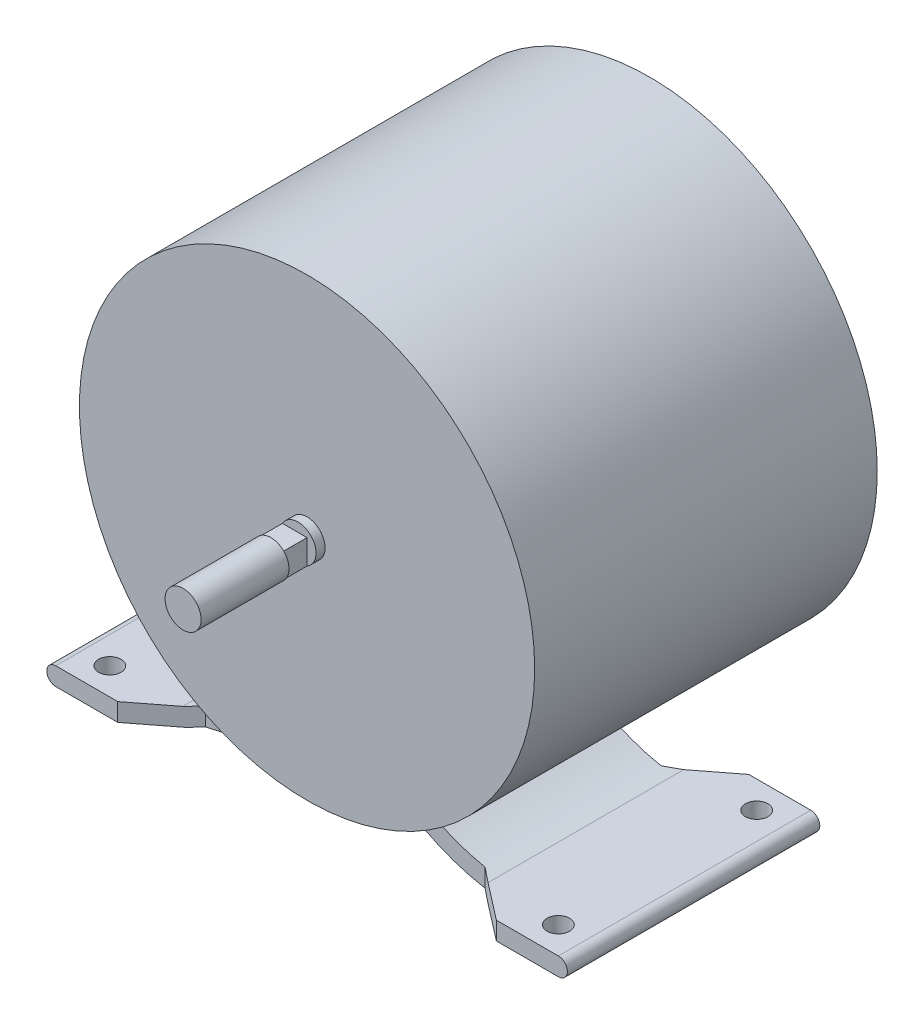
ISO-10303-21;
HEADER;
FILE_DESCRIPTION(('STEP AP214'),'2;1');
FILE_NAME('part.step','',(''),(''),'','','');
FILE_SCHEMA(('AUTOMOTIVE_DESIGN { 1 0 10303 214 1 1 1 1 }'));
ENDSEC;
DATA;
#1=APPLICATION_CONTEXT('core data for automotive mechanical design processes');
#2=APPLICATION_PROTOCOL_DEFINITION('international standard','automotive_design',2000,#1);
#3=PRODUCT_CONTEXT('',#1,'mechanical');
#4=PRODUCT('Part','Part','',(#3));
#5=PRODUCT_RELATED_PRODUCT_CATEGORY('part','',(#4));
#6=PRODUCT_DEFINITION_FORMATION('','',#4);
#7=PRODUCT_DEFINITION_CONTEXT('part definition',#1,'design');
#8=PRODUCT_DEFINITION('design','',#6,#7);
#9=PRODUCT_DEFINITION_SHAPE('','',#8);
#10=(LENGTH_UNIT() NAMED_UNIT(*) SI_UNIT(.MILLI.,.METRE.));
#11=(NAMED_UNIT(*) PLANE_ANGLE_UNIT() SI_UNIT($,.RADIAN.));
#12=(NAMED_UNIT(*) SI_UNIT($,.STERADIAN.) SOLID_ANGLE_UNIT());
#13=UNCERTAINTY_MEASURE_WITH_UNIT(LENGTH_MEASURE(1.E-05),#10,'distance_accuracy_value','');
#14=(GEOMETRIC_REPRESENTATION_CONTEXT(3) GLOBAL_UNCERTAINTY_ASSIGNED_CONTEXT((#13)) GLOBAL_UNIT_ASSIGNED_CONTEXT((#10,
#11,#12)) REPRESENTATION_CONTEXT('',''));
#15=CARTESIAN_POINT('',(0.,0.,0.));
#16=DIRECTION('',(0.,0.,1.));
#17=DIRECTION('',(1.,0.,0.));
#18=AXIS2_PLACEMENT_3D('',#15,#16,#17);
#19=CARTESIAN_POINT('',(0.,0.,0.));
#20=DIRECTION('',(0.,0.,1.));
#21=DIRECTION('',(1.,0.,0.));
#22=AXIS2_PLACEMENT_3D('',#19,#20,#21);
#23=PLANE('',#22);
#24=DIRECTION('',(0.,-1.,0.));
#25=VECTOR('',#24,1.);
#26=CARTESIAN_POINT('',(-42.,-42.5,0.));
#27=LINE('',#26,#25);
#28=CARTESIAN_POINT('',(-42.,-52.5,0.));
#29=VERTEX_POINT('',#28);
#30=CARTESIAN_POINT('',(-42.,-56.5,0.));
#31=VERTEX_POINT('',#30);
#32=EDGE_CURVE('E258',#29,#31,#27,.T.);
#33=ORIENTED_EDGE('',*,*,#32,.F.);
#34=DIRECTION('',(1.,0.,0.));
#35=VECTOR('',#34,1.);
#36=CARTESIAN_POINT('',(-55.75,-52.5,0.));
#37=LINE('',#36,#35);
#38=CARTESIAN_POINT('',(-55.75,-52.5,0.));
#39=VERTEX_POINT('',#38);
#40=EDGE_CURVE('E325',#39,#29,#37,.T.);
#41=ORIENTED_EDGE('',*,*,#40,.F.);
#42=CARTESIAN_POINT('',(-55.75,-54.5,0.));
#43=DIRECTION('',(0.,0.,1.));
#44=DIRECTION('',(1.,0.,0.));
#45=AXIS2_PLACEMENT_3D('',#42,#43,#44);
#46=CIRCLE('',#45,2.);
#47=CARTESIAN_POINT('',(-55.75,-56.5,0.));
#48=VERTEX_POINT('',#47);
#49=EDGE_CURVE('E330',#39,#48,#46,.T.);
#50=ORIENTED_EDGE('',*,*,#49,.T.);
#51=DIRECTION('',(1.,0.,0.));
#52=VECTOR('',#51,1.);
#53=CARTESIAN_POINT('',(-55.75,-56.5,0.));
#54=LINE('',#53,#52);
#55=EDGE_CURVE('E353',#48,#31,#54,.T.);
#56=ORIENTED_EDGE('',*,*,#55,.T.);
#57=EDGE_LOOP('',(#33,#41,#50,#56));
#58=FACE_BOUND('',#57,.T.);
#59=ADVANCED_FACE('F47',(#58),#23,.T.);
#60=CARTESIAN_POINT('',(0.,0.,0.));
#61=DIRECTION('',(0.,0.,1.));
#62=DIRECTION('',(1.,0.,0.));
#63=AXIS2_PLACEMENT_3D('',#60,#61,#62);
#64=CIRCLE('',#63,4.);
#65=CARTESIAN_POINT('',(4.,0.,0.));
#66=VERTEX_POINT('',#65);
#67=EDGE_CURVE('E395',#66,#66,#64,.T.);
#68=ORIENTED_EDGE('',*,*,#67,.F.);
#69=EDGE_LOOP('',(#68));
#70=FACE_BOUND('',#69,.T.);
#71=CARTESIAN_POINT('',(0.,0.,0.));
#72=DIRECTION('',(0.,0.,1.));
#73=DIRECTION('',(1.,0.,0.));
#74=AXIS2_PLACEMENT_3D('',#71,#72,#73);
#75=CIRCLE('',#74,50.5);
#76=CARTESIAN_POINT('',(50.5,0.,0.));
#77=VERTEX_POINT('',#76);
#78=EDGE_CURVE('E451',#77,#77,#75,.T.);
#79=ORIENTED_EDGE('',*,*,#78,.T.);
#80=EDGE_LOOP('',(#79));
#81=FACE_BOUND('',#80,.T.);
#82=ADVANCED_FACE('F429',(#70,#81),#23,.T.);
#83=CARTESIAN_POINT('',(-38.7375943856709,-11.7087805856879,-56.));
#84=DIRECTION('',(0.,0.,1.));
#85=DIRECTION('',(1.,0.,0.));
#86=AXIS2_PLACEMENT_3D('',#83,#84,#85);
#87=PLANE('',#86);
#88=DIRECTION('',(1.,0.,0.));
#89=VECTOR('',#88,1.);
#90=CARTESIAN_POINT('',(-55.75,-52.5,-56.));
#91=LINE('',#90,#89);
#92=CARTESIAN_POINT('',(-55.75,-52.5,-56.));
#93=VERTEX_POINT('',#92);
#94=CARTESIAN_POINT('',(-42.,-52.5,-56.));
#95=VERTEX_POINT('',#94);
#96=EDGE_CURVE('E326',#93,#95,#91,.T.);
#97=ORIENTED_EDGE('',*,*,#96,.T.);
#98=DIRECTION('',(0.,-1.,0.));
#99=VECTOR('',#98,1.);
#100=CARTESIAN_POINT('',(-42.,-11.7087805856879,-56.));
#101=LINE('',#100,#99);
#102=CARTESIAN_POINT('',(-42.,-56.5,-56.));
#103=VERTEX_POINT('',#102);
#104=EDGE_CURVE('E457',#95,#103,#101,.T.);
#105=ORIENTED_EDGE('',*,*,#104,.T.);
#106=DIRECTION('',(1.,0.,0.));
#107=VECTOR('',#106,1.);
#108=CARTESIAN_POINT('',(-55.75,-56.5,-56.));
#109=LINE('',#108,#107);
#110=CARTESIAN_POINT('',(-55.75,-56.5,-56.));
#111=VERTEX_POINT('',#110);
#112=EDGE_CURVE('E337',#111,#103,#109,.T.);
#113=ORIENTED_EDGE('',*,*,#112,.F.);
#114=CARTESIAN_POINT('',(-55.75,-54.5,-56.));
#115=DIRECTION('',(0.,0.,1.));
#116=DIRECTION('',(1.,0.,0.));
#117=AXIS2_PLACEMENT_3D('',#114,#115,#116);
#118=CIRCLE('',#117,2.);
#119=EDGE_CURVE('E340',#93,#111,#118,.T.);
#120=ORIENTED_EDGE('',*,*,#119,.F.);
#121=EDGE_LOOP('',(#97,#105,#113,#120));
#122=FACE_BOUND('',#121,.T.);
#123=ADVANCED_FACE('F434',(#122),#87,.F.);
#124=CARTESIAN_POINT('',(0.,0.,-76.));
#125=DIRECTION('',(0.,0.,1.));
#126=DIRECTION('',(1.,0.,0.));
#127=AXIS2_PLACEMENT_3D('',#124,#125,#126);
#128=CYLINDRICAL_SURFACE('',#127,50.5);
#129=DIRECTION('',(0.,0.,1.));
#130=VECTOR('',#129,1.);
#131=CARTESIAN_POINT('',(18.0122274424441,-47.1784872856439,-56.));
#132=LINE('',#131,#130);
#133=CARTESIAN_POINT('',(18.0122274424441,-47.1784872856439,-47.5));
#134=VERTEX_POINT('',#133);
#135=CARTESIAN_POINT('',(18.0122274424441,-47.1784872856439,-8.50000000000001));
#136=VERTEX_POINT('',#135);
#137=EDGE_CURVE('E382',#134,#136,#132,.T.);
#138=ORIENTED_EDGE('',*,*,#137,.F.);
#139=CARTESIAN_POINT('',(0.,0.,-47.5));
#140=DIRECTION('',(0.,0.,1.));
#141=DIRECTION('',(1.,0.,0.));
#142=AXIS2_PLACEMENT_3D('',#139,#140,#141);
#143=CIRCLE('',#142,50.5);
#144=CARTESIAN_POINT('',(-18.0122274424441,-47.1784872856439,-47.5));
#145=VERTEX_POINT('',#144);
#146=EDGE_CURVE('E249',#145,#134,#143,.T.);
#147=ORIENTED_EDGE('',*,*,#146,.F.);
#148=DIRECTION('',(0.,0.,1.));
#149=VECTOR('',#148,1.);
#150=CARTESIAN_POINT('',(-18.0122274424441,-47.1784872856439,-56.));
#151=LINE('',#150,#149);
#152=CARTESIAN_POINT('',(-18.0122274424441,-47.1784872856439,-8.50000000000001));
#153=VERTEX_POINT('',#152);
#154=EDGE_CURVE('E385',#145,#153,#151,.T.);
#155=ORIENTED_EDGE('',*,*,#154,.T.);
#156=CARTESIAN_POINT('',(0.,0.,-8.50000000000001));
#157=DIRECTION('',(0.,0.,-1.));
#158=DIRECTION('',(-1.,0.,0.));
#159=AXIS2_PLACEMENT_3D('',#156,#157,#158);
#160=CIRCLE('',#159,50.5);
#161=EDGE_CURVE('E245',#136,#153,#160,.T.);
#162=ORIENTED_EDGE('',*,*,#161,.F.);
#163=EDGE_LOOP('',(#138,#147,#155,#162));
#164=FACE_BOUND('',#163,.T.);
#165=ORIENTED_EDGE('',*,*,#78,.F.);
#166=EDGE_LOOP('',(#165));
#167=FACE_BOUND('',#166,.T.);
#168=CARTESIAN_POINT('',(0.,0.,-76.));
#169=DIRECTION('',(0.,0.,1.));
#170=DIRECTION('',(1.,0.,0.));
#171=AXIS2_PLACEMENT_3D('',#168,#169,#170);
#172=CIRCLE('',#171,50.5);
#173=CARTESIAN_POINT('',(50.5,0.,-76.));
#174=VERTEX_POINT('',#173);
#175=EDGE_CURVE('E392',#174,#174,#172,.F.);
#176=ORIENTED_EDGE('',*,*,#175,.F.);
#177=EDGE_LOOP('',(#176));
#178=FACE_BOUND('',#177,.T.);
#179=ADVANCED_FACE('F49',(#164,#167,#178),#128,.T.);
#180=DIRECTION('',(0.,-1.,0.));
#181=VECTOR('',#180,1.);
#182=CARTESIAN_POINT('',(42.,-42.5,0.));
#183=LINE('',#182,#181);
#184=CARTESIAN_POINT('',(42.,-52.5,0.));
#185=VERTEX_POINT('',#184);
#186=CARTESIAN_POINT('',(42.,-56.5,0.));
#187=VERTEX_POINT('',#186);
#188=EDGE_CURVE('E261',#185,#187,#183,.T.);
#189=ORIENTED_EDGE('',*,*,#188,.T.);
#190=DIRECTION('',(1.,0.,0.));
#191=VECTOR('',#190,1.);
#192=CARTESIAN_POINT('',(33.6351588391696,-56.5,0.));
#193=LINE('',#192,#191);
#194=CARTESIAN_POINT('',(55.75,-56.5,0.));
#195=VERTEX_POINT('',#194);
#196=EDGE_CURVE('E351',#187,#195,#193,.T.);
#197=ORIENTED_EDGE('',*,*,#196,.T.);
#198=CARTESIAN_POINT('',(55.75,-54.5,0.));
#199=DIRECTION('',(0.,0.,-1.));
#200=DIRECTION('',(-1.,0.,0.));
#201=AXIS2_PLACEMENT_3D('',#198,#199,#200);
#202=CIRCLE('',#201,2.);
#203=CARTESIAN_POINT('',(55.75,-52.5,0.));
#204=VERTEX_POINT('',#203);
#205=EDGE_CURVE('E348',#204,#195,#202,.T.);
#206=ORIENTED_EDGE('',*,*,#205,.F.);
#207=DIRECTION('',(1.,0.,0.));
#208=VECTOR('',#207,1.);
#209=CARTESIAN_POINT('',(33.8675484920727,-52.5,0.));
#210=LINE('',#209,#208);
#211=EDGE_CURVE('E346',#185,#204,#210,.T.);
#212=ORIENTED_EDGE('',*,*,#211,.F.);
#213=EDGE_LOOP('',(#189,#197,#206,#212));
#214=FACE_BOUND('',#213,.T.);
#215=ADVANCED_FACE('F426',(#214),#23,.T.);
#216=CARTESIAN_POINT('',(0.,0.,27.5));
#217=DIRECTION('',(0.,0.,-1.));
#218=DIRECTION('',(-1.,0.,0.));
#219=AXIS2_PLACEMENT_3D('',#216,#217,#218);
#220=CYLINDRICAL_SURFACE('',#219,4.);
#221=CARTESIAN_POINT('',(0.,0.,2.));
#222=DIRECTION('',(0.,0.,-1.));
#223=DIRECTION('',(-1.,0.,0.));
#224=AXIS2_PLACEMENT_3D('',#221,#222,#223);
#225=CIRCLE('',#224,4.);
#226=CARTESIAN_POINT('',(-3.46410161513775,2.,2.));
#227=VERTEX_POINT('',#226);
#228=CARTESIAN_POINT('',(1.99999999999999,-3.46410161513776,2.));
#229=VERTEX_POINT('',#228);
#230=EDGE_CURVE('E12',#227,#229,#225,.T.);
#231=ORIENTED_EDGE('',*,*,#230,.T.);
#232=DIRECTION('',(0.,0.,-1.));
#233=VECTOR('',#232,1.);
#234=CARTESIAN_POINT('',(1.99999999999999,-3.46410161513776,27.5));
#235=LINE('',#234,#233);
#236=CARTESIAN_POINT('',(1.99999999999999,-3.46410161513776,8.00000000000001));
#237=VERTEX_POINT('',#236);
#238=EDGE_CURVE('E207',#229,#237,#235,.F.);
#239=ORIENTED_EDGE('',*,*,#238,.T.);
#240=CARTESIAN_POINT('',(0.,0.,8.00000000000001));
#241=DIRECTION('',(0.,0.,1.));
#242=DIRECTION('',(1.,0.,0.));
#243=AXIS2_PLACEMENT_3D('',#240,#241,#242);
#244=CIRCLE('',#243,4.);
#245=CARTESIAN_POINT('',(-3.46410161513775,2.,8.00000000000001));
#246=VERTEX_POINT('',#245);
#247=EDGE_CURVE('E69',#237,#246,#244,.T.);
#248=ORIENTED_EDGE('',*,*,#247,.T.);
#249=DIRECTION('',(0.,0.,-1.));
#250=VECTOR('',#249,1.);
#251=CARTESIAN_POINT('',(-3.46410161513775,2.,27.5));
#252=LINE('',#251,#250);
#253=EDGE_CURVE('E55',#246,#227,#252,.T.);
#254=ORIENTED_EDGE('',*,*,#253,.T.);
#255=EDGE_LOOP('',(#231,#239,#248,#254));
#256=FACE_BOUND('',#255,.T.);
#257=CARTESIAN_POINT('',(0.,0.,27.5));
#258=DIRECTION('',(0.,0.,1.));
#259=DIRECTION('',(1.,0.,0.));
#260=AXIS2_PLACEMENT_3D('',#257,#258,#259);
#261=CIRCLE('',#260,4.);
#262=CARTESIAN_POINT('',(4.,0.,27.5));
#263=VERTEX_POINT('',#262);
#264=EDGE_CURVE('E454',#263,#263,#261,.T.);
#265=ORIENTED_EDGE('',*,*,#264,.F.);
#266=EDGE_LOOP('',(#265));
#267=FACE_BOUND('',#266,.T.);
#268=ORIENTED_EDGE('',*,*,#67,.T.);
#269=EDGE_LOOP('',(#268));
#270=FACE_BOUND('',#269,.T.);
#271=ADVANCED_FACE('F423',(#256,#267,#270),#220,.T.);
#272=CARTESIAN_POINT('',(0.,0.,27.5));
#273=DIRECTION('',(0.,0.,1.));
#274=DIRECTION('',(1.,0.,0.));
#275=AXIS2_PLACEMENT_3D('',#272,#273,#274);
#276=PLANE('',#275);
#277=ORIENTED_EDGE('',*,*,#264,.T.);
#278=EDGE_LOOP('',(#277));
#279=FACE_BOUND('',#278,.T.);
#280=ADVANCED_FACE('F420',(#279),#276,.T.);
#281=CARTESIAN_POINT('',(0.,0.,-82.));
#282=DIRECTION('',(0.,0.,-1.));
#283=DIRECTION('',(-1.,0.,0.));
#284=AXIS2_PLACEMENT_3D('',#281,#282,#283);
#285=PLANE('',#284);
#286=CARTESIAN_POINT('',(0.,0.,-82.));
#287=DIRECTION('',(0.,0.,-1.));
#288=DIRECTION('',(-1.,0.,0.));
#289=AXIS2_PLACEMENT_3D('',#286,#287,#288);
#290=CIRCLE('',#289,15.5);
#291=CARTESIAN_POINT('',(-15.5,0.,-82.));
#292=VERTEX_POINT('',#291);
#293=EDGE_CURVE('E391',#292,#292,#290,.T.);
#294=ORIENTED_EDGE('',*,*,#293,.T.);
#295=EDGE_LOOP('',(#294));
#296=FACE_BOUND('',#295,.T.);
#297=ADVANCED_FACE('F416',(#296),#285,.T.);
#298=CARTESIAN_POINT('',(0.,0.,-82.));
#299=DIRECTION('',(0.,0.,1.));
#300=DIRECTION('',(1.,0.,0.));
#301=AXIS2_PLACEMENT_3D('',#298,#299,#300);
#302=CONICAL_SURFACE('',#301,15.5,1.40101805282656);
#303=ORIENTED_EDGE('',*,*,#175,.T.);
#304=EDGE_LOOP('',(#303));
#305=FACE_BOUND('',#304,.T.);
#306=ORIENTED_EDGE('',*,*,#293,.F.);
#307=EDGE_LOOP('',(#306));
#308=FACE_BOUND('',#307,.T.);
#309=ADVANCED_FACE('F405',(#305,#308),#302,.T.);
#310=CARTESIAN_POINT('',(-55.75,-52.5,-56.));
#311=DIRECTION('',(0.,-1.,0.));
#312=DIRECTION('',(0.,0.,-1.));
#313=AXIS2_PLACEMENT_3D('',#310,#311,#312);
#314=PLANE('',#313);
#315=CARTESIAN_POINT('',(-49.75,-52.5,-50.));
#316=DIRECTION('',(0.,-1.,0.));
#317=DIRECTION('',(0.,0.,-1.));
#318=AXIS2_PLACEMENT_3D('',#315,#316,#317);
#319=CIRCLE('',#318,2.5);
#320=CARTESIAN_POINT('',(-49.75,-52.5,-52.5));
#321=VERTEX_POINT('',#320);
#322=EDGE_CURVE('E227',#321,#321,#319,.F.);
#323=ORIENTED_EDGE('',*,*,#322,.F.);
#324=EDGE_LOOP('',(#323));
#325=FACE_BOUND('',#324,.T.);
#326=CARTESIAN_POINT('',(-49.75,-52.5,-6.));
#327=DIRECTION('',(0.,-1.,0.));
#328=DIRECTION('',(0.,0.,-1.));
#329=AXIS2_PLACEMENT_3D('',#326,#327,#328);
#330=CIRCLE('',#329,2.5);
#331=CARTESIAN_POINT('',(-49.75,-52.5,-8.5));
#332=VERTEX_POINT('',#331);
#333=EDGE_CURVE('E242',#332,#332,#330,.F.);
#334=ORIENTED_EDGE('',*,*,#333,.F.);
#335=EDGE_LOOP('',(#334));
#336=FACE_BOUND('',#335,.T.);
#337=ORIENTED_EDGE('',*,*,#40,.T.);
#338=DIRECTION('',(0.791285001392167,0.,-0.611447501075766));
#339=VECTOR('',#338,1.);
#340=CARTESIAN_POINT('',(-23.5148771021992,-52.5,-14.2839586028461));
#341=LINE('',#340,#339);
#342=CARTESIAN_POINT('',(-33.8675484920727,-52.5,-6.28416707430744));
#343=VERTEX_POINT('',#342);
#344=EDGE_CURVE('E297',#29,#343,#341,.T.);
#345=ORIENTED_EDGE('',*,*,#344,.T.);
#346=DIRECTION('',(0.,0.,1.));
#347=VECTOR('',#346,1.);
#348=CARTESIAN_POINT('',(-33.8675484920727,-52.5,-56.));
#349=LINE('',#348,#347);
#350=CARTESIAN_POINT('',(-33.8675484920727,-52.5,-49.7158329256926));
#351=VERTEX_POINT('',#350);
#352=EDGE_CURVE('E388',#351,#343,#349,.T.);
#353=ORIENTED_EDGE('',*,*,#352,.F.);
#354=DIRECTION('',(-0.791285001392167,0.,-0.611447501075766));
#355=VECTOR('',#354,1.);
#356=CARTESIAN_POINT('',(-50.6093143596378,-52.5,-62.6526520051746));
#357=LINE('',#356,#355);
#358=EDGE_CURVE('E289',#351,#95,#357,.T.);
#359=ORIENTED_EDGE('',*,*,#358,.T.);
#360=ORIENTED_EDGE('',*,*,#96,.F.);
#361=DIRECTION('',(0.,0.,1.));
#362=VECTOR('',#361,1.);
#363=CARTESIAN_POINT('',(-55.75,-52.5,-56.));
#364=LINE('',#363,#362);
#365=EDGE_CURVE('E343',#93,#39,#364,.T.);
#366=ORIENTED_EDGE('',*,*,#365,.T.);
#367=EDGE_LOOP('',(#337,#345,#353,#359,#360,#366));
#368=FACE_BOUND('',#367,.T.);
#369=ADVANCED_FACE('F415',(#325,#336,#368),#314,.F.);
#370=CARTESIAN_POINT('',(-38.7375943856709,-11.7087805856879,-56.));
#371=DIRECTION('',(0.,0.,1.));
#372=DIRECTION('',(1.,0.,0.));
#373=AXIS2_PLACEMENT_3D('',#370,#371,#372);
#374=CYLINDRICAL_SURFACE('',#373,41.0809071018679);
#375=ORIENTED_EDGE('',*,*,#352,.T.);
#376=CARTESIAN_POINT('',(-38.7375943856709,-11.7087805856879,-2.5209497928907));
#377=DIRECTION('',(-0.611447501075766,0.,-0.791285001392167));
#378=DIRECTION('',(-0.791285001392167,0.,0.611447501075766));
#379=AXIS2_PLACEMENT_3D('',#376,#377,#378);
#380=ELLIPSE('',#379,51.9167013523461,41.0809071018679);
#381=CARTESIAN_POINT('',(-31.,-52.0544192773128,-8.50000000000001));
#382=VERTEX_POINT('',#381);
#383=EDGE_CURVE('E294',#343,#382,#380,.F.);
#384=ORIENTED_EDGE('',*,*,#383,.T.);
#385=CARTESIAN_POINT('',(-38.7375943856709,-11.7087805856879,-8.50000000000001));
#386=DIRECTION('',(0.,0.,-1.));
#387=DIRECTION('',(-1.,0.,0.));
#388=AXIS2_PLACEMENT_3D('',#385,#386,#387);
#389=CIRCLE('',#388,41.0809071018679);
#390=EDGE_CURVE('E317',#382,#153,#389,.F.);
#391=ORIENTED_EDGE('',*,*,#390,.T.);
#392=ORIENTED_EDGE('',*,*,#154,.F.);
#393=CARTESIAN_POINT('',(-38.7375943856709,-11.7087805856879,-47.5));
#394=DIRECTION('',(0.,0.,1.));
#395=DIRECTION('',(1.,0.,0.));
#396=AXIS2_PLACEMENT_3D('',#393,#394,#395);
#397=CIRCLE('',#396,41.0809071018679);
#398=CARTESIAN_POINT('',(-31.,-52.0544192773128,-47.5));
#399=VERTEX_POINT('',#398);
#400=EDGE_CURVE('E307',#145,#399,#397,.F.);
#401=ORIENTED_EDGE('',*,*,#400,.T.);
#402=CARTESIAN_POINT('',(-38.7375943856709,-11.7087805856879,-53.4790502071093));
#403=DIRECTION('',(-0.611447501075766,0.,0.791285001392167));
#404=DIRECTION('',(0.791285001392167,0.,0.611447501075766));
#405=AXIS2_PLACEMENT_3D('',#402,#403,#404);
#406=ELLIPSE('',#405,51.9167013523462,41.0809071018679);
#407=EDGE_CURVE('E286',#399,#351,#406,.F.);
#408=ORIENTED_EDGE('',*,*,#407,.T.);
#409=EDGE_LOOP('',(#375,#384,#391,#392,#401,#408));
#410=FACE_BOUND('',#409,.T.);
#411=ADVANCED_FACE('F523',(#410),#374,.F.);
#412=CARTESIAN_POINT('',(38.7375943856709,-11.7087805856879,-56.));
#413=DIRECTION('',(0.,0.,1.));
#414=DIRECTION('',(1.,0.,0.));
#415=AXIS2_PLACEMENT_3D('',#412,#413,#414);
#416=CYLINDRICAL_SURFACE('',#415,41.0809071018679);
#417=CARTESIAN_POINT('',(38.7375943856709,-11.7087805856879,-2.5209497928907));
#418=DIRECTION('',(0.611447501075766,0.,-0.791285001392167));
#419=DIRECTION('',(0.791285001392167,0.,0.611447501075766));
#420=AXIS2_PLACEMENT_3D('',#417,#418,#419);
#421=ELLIPSE('',#420,51.9167013523461,41.0809071018679);
#422=CARTESIAN_POINT('',(33.8675484920727,-52.5,-6.28416707430748));
#423=VERTEX_POINT('',#422);
#424=CARTESIAN_POINT('',(31.,-52.0544192773128,-8.50000000000001));
#425=VERTEX_POINT('',#424);
#426=EDGE_CURVE('E323',#423,#425,#421,.T.);
#427=ORIENTED_EDGE('',*,*,#426,.F.);
#428=DIRECTION('',(0.,0.,1.));
#429=VECTOR('',#428,1.);
#430=CARTESIAN_POINT('',(33.8675484920727,-52.5,-56.));
#431=LINE('',#430,#429);
#432=CARTESIAN_POINT('',(33.8675484920727,-52.5,-49.7158329256925));
#433=VERTEX_POINT('',#432);
#434=EDGE_CURVE('E379',#433,#423,#431,.T.);
#435=ORIENTED_EDGE('',*,*,#434,.F.);
#436=CARTESIAN_POINT('',(38.7375943856709,-11.7087805856879,-53.4790502071093));
#437=DIRECTION('',(0.611447501075766,0.,0.791285001392167));
#438=DIRECTION('',(-0.791285001392167,0.,0.611447501075766));
#439=AXIS2_PLACEMENT_3D('',#436,#437,#438);
#440=ELLIPSE('',#439,51.9167013523461,41.0809071018679);
#441=CARTESIAN_POINT('',(31.,-52.0544192773128,-47.5));
#442=VERTEX_POINT('',#441);
#443=EDGE_CURVE('E282',#442,#433,#440,.T.);
#444=ORIENTED_EDGE('',*,*,#443,.F.);
#445=CARTESIAN_POINT('',(38.7375943856709,-11.7087805856879,-47.5));
#446=DIRECTION('',(0.,0.,1.));
#447=DIRECTION('',(1.,0.,0.));
#448=AXIS2_PLACEMENT_3D('',#445,#446,#447);
#449=CIRCLE('',#448,41.0809071018679);
#450=EDGE_CURVE('E305',#134,#442,#449,.T.);
#451=ORIENTED_EDGE('',*,*,#450,.F.);
#452=ORIENTED_EDGE('',*,*,#137,.T.);
#453=CARTESIAN_POINT('',(38.7375943856709,-11.7087805856879,-8.50000000000001));
#454=DIRECTION('',(0.,0.,-1.));
#455=DIRECTION('',(-1.,0.,0.));
#456=AXIS2_PLACEMENT_3D('',#453,#454,#455);
#457=CIRCLE('',#456,41.0809071018679);
#458=EDGE_CURVE('E315',#425,#136,#457,.T.);
#459=ORIENTED_EDGE('',*,*,#458,.F.);
#460=EDGE_LOOP('',(#427,#435,#444,#451,#452,#459));
#461=FACE_BOUND('',#460,.T.);
#462=ADVANCED_FACE('F498',(#461),#416,.F.);
#463=CARTESIAN_POINT('',(33.8675484920727,-52.5,-56.));
#464=DIRECTION('',(0.,-1.,0.));
#465=DIRECTION('',(0.,0.,-1.));
#466=AXIS2_PLACEMENT_3D('',#463,#464,#465);
#467=PLANE('',#466);
#468=CARTESIAN_POINT('',(49.75,-52.5,-5.99999999999996));
#469=DIRECTION('',(0.,-1.,0.));
#470=DIRECTION('',(0.,0.,-1.));
#471=AXIS2_PLACEMENT_3D('',#468,#469,#470);
#472=CIRCLE('',#471,2.5);
#473=CARTESIAN_POINT('',(49.75,-52.5,-8.49999999999996));
#474=VERTEX_POINT('',#473);
#475=EDGE_CURVE('E222',#474,#474,#472,.F.);
#476=ORIENTED_EDGE('',*,*,#475,.F.);
#477=EDGE_LOOP('',(#476));
#478=FACE_BOUND('',#477,.T.);
#479=CARTESIAN_POINT('',(49.75,-52.5,-50.));
#480=DIRECTION('',(0.,-1.,0.));
#481=DIRECTION('',(0.,0.,-1.));
#482=AXIS2_PLACEMENT_3D('',#479,#480,#481);
#483=CIRCLE('',#482,2.5);
#484=CARTESIAN_POINT('',(49.75,-52.5,-52.5));
#485=VERTEX_POINT('',#484);
#486=EDGE_CURVE('E234',#485,#485,#483,.F.);
#487=ORIENTED_EDGE('',*,*,#486,.F.);
#488=EDGE_LOOP('',(#487));
#489=FACE_BOUND('',#488,.T.);
#490=ORIENTED_EDGE('',*,*,#434,.T.);
#491=DIRECTION('',(0.791285001392167,0.,0.611447501075766));
#492=VECTOR('',#491,1.);
#493=CARTESIAN_POINT('',(9.8135749937428,-52.5,-24.871328413926));
#494=LINE('',#493,#492);
#495=EDGE_CURVE('E320',#423,#185,#494,.T.);
#496=ORIENTED_EDGE('',*,*,#495,.T.);
#497=ORIENTED_EDGE('',*,*,#211,.T.);
#498=DIRECTION('',(0.,0.,1.));
#499=VECTOR('',#498,1.);
#500=CARTESIAN_POINT('',(55.75,-52.5,-56.));
#501=LINE('',#500,#499);
#502=CARTESIAN_POINT('',(55.75,-52.5,-56.));
#503=VERTEX_POINT('',#502);
#504=EDGE_CURVE('E376',#503,#204,#501,.T.);
#505=ORIENTED_EDGE('',*,*,#504,.F.);
#506=DIRECTION('',(1.,0.,0.));
#507=VECTOR('',#506,1.);
#508=CARTESIAN_POINT('',(33.8675484920727,-52.5,-56.));
#509=LINE('',#508,#507);
#510=CARTESIAN_POINT('',(42.,-52.5,-56.));
#511=VERTEX_POINT('',#510);
#512=EDGE_CURVE('E329',#511,#503,#509,.T.);
#513=ORIENTED_EDGE('',*,*,#512,.F.);
#514=DIRECTION('',(-0.791285001392167,0.,0.611447501075766));
#515=VECTOR('',#514,1.);
#516=CARTESIAN_POINT('',(36.9080122511813,-52.5,-52.0652821940947));
#517=LINE('',#516,#515);
#518=EDGE_CURVE('E279',#511,#433,#517,.T.);
#519=ORIENTED_EDGE('',*,*,#518,.T.);
#520=EDGE_LOOP('',(#490,#496,#497,#505,#513,#519));
#521=FACE_BOUND('',#520,.T.);
#522=ADVANCED_FACE('F492',(#478,#489,#521),#467,.F.);
#523=CARTESIAN_POINT('',(55.75,-54.5,-56.));
#524=DIRECTION('',(0.,0.,1.));
#525=DIRECTION('',(1.,0.,0.));
#526=AXIS2_PLACEMENT_3D('',#523,#524,#525);
#527=CYLINDRICAL_SURFACE('',#526,2.);
#528=ORIENTED_EDGE('',*,*,#205,.T.);
#529=DIRECTION('',(0.,0.,1.));
#530=VECTOR('',#529,1.);
#531=CARTESIAN_POINT('',(55.75,-56.5,-56.));
#532=LINE('',#531,#530);
#533=CARTESIAN_POINT('',(55.75,-56.5,-56.));
#534=VERTEX_POINT('',#533);
#535=EDGE_CURVE('E373',#534,#195,#532,.T.);
#536=ORIENTED_EDGE('',*,*,#535,.F.);
#537=CARTESIAN_POINT('',(55.75,-54.5,-56.));
#538=DIRECTION('',(0.,0.,-1.));
#539=DIRECTION('',(-1.,0.,0.));
#540=AXIS2_PLACEMENT_3D('',#537,#538,#539);
#541=CIRCLE('',#540,2.);
#542=EDGE_CURVE('E332',#503,#534,#541,.T.);
#543=ORIENTED_EDGE('',*,*,#542,.F.);
#544=ORIENTED_EDGE('',*,*,#504,.T.);
#545=EDGE_LOOP('',(#528,#536,#543,#544));
#546=FACE_BOUND('',#545,.T.);
#547=ADVANCED_FACE('F548',(#546),#527,.T.);
#548=CARTESIAN_POINT('',(33.6351588391696,-56.5,-56.));
#549=DIRECTION('',(0.,-1.,0.));
#550=DIRECTION('',(0.,0.,-1.));
#551=AXIS2_PLACEMENT_3D('',#548,#549,#550);
#552=PLANE('',#551);
#553=CARTESIAN_POINT('',(49.75,-56.5,-5.99999999999996));
#554=DIRECTION('',(0.,-1.,0.));
#555=DIRECTION('',(0.,0.,1.));
#556=AXIS2_PLACEMENT_3D('',#553,#554,#555);
#557=CIRCLE('',#556,2.5);
#558=CARTESIAN_POINT('',(49.75,-56.5,-3.49999999999995));
#559=VERTEX_POINT('',#558);
#560=EDGE_CURVE('E219',#559,#559,#557,.T.);
#561=ORIENTED_EDGE('',*,*,#560,.F.);
#562=EDGE_LOOP('',(#561));
#563=FACE_BOUND('',#562,.T.);
#564=CARTESIAN_POINT('',(49.75,-56.5,-50.));
#565=DIRECTION('',(0.,-1.,0.));
#566=DIRECTION('',(0.,0.,-1.));
#567=AXIS2_PLACEMENT_3D('',#564,#565,#566);
#568=CIRCLE('',#567,2.5);
#569=CARTESIAN_POINT('',(49.75,-56.5,-52.5));
#570=VERTEX_POINT('',#569);
#571=EDGE_CURVE('E237',#570,#570,#568,.T.);
#572=ORIENTED_EDGE('',*,*,#571,.F.);
#573=EDGE_LOOP('',(#572));
#574=FACE_BOUND('',#573,.T.);
#575=DIRECTION('',(0.791285001392167,0.,0.611447501075766));
#576=VECTOR('',#575,1.);
#577=CARTESIAN_POINT('',(31.,-56.5,-8.50000000000001));
#578=LINE('',#577,#576);
#579=CARTESIAN_POINT('',(33.6351588391698,-56.5,-6.46374089700517));
#580=VERTEX_POINT('',#579);
#581=EDGE_CURVE('E254',#580,#187,#578,.T.);
#582=ORIENTED_EDGE('',*,*,#581,.F.);
#583=DIRECTION('',(0.,0.,1.));
#584=VECTOR('',#583,1.);
#585=CARTESIAN_POINT('',(33.6351588391696,-56.5,-56.));
#586=LINE('',#585,#584);
#587=CARTESIAN_POINT('',(33.6351588391698,-56.5,-49.5362591029948));
#588=VERTEX_POINT('',#587);
#589=EDGE_CURVE('E370',#588,#580,#586,.T.);
#590=ORIENTED_EDGE('',*,*,#589,.F.);
#591=DIRECTION('',(-0.791285001392167,0.,0.611447501075766));
#592=VECTOR('',#591,1.);
#593=CARTESIAN_POINT('',(31.,-56.5,-47.5));
#594=LINE('',#593,#592);
#595=CARTESIAN_POINT('',(42.,-56.5,-56.));
#596=VERTEX_POINT('',#595);
#597=EDGE_CURVE('E251',#596,#588,#594,.T.);
#598=ORIENTED_EDGE('',*,*,#597,.F.);
#599=DIRECTION('',(1.,0.,0.));
#600=VECTOR('',#599,1.);
#601=CARTESIAN_POINT('',(33.6351588391696,-56.5,-56.));
#602=LINE('',#601,#600);
#603=EDGE_CURVE('E335',#596,#534,#602,.T.);
#604=ORIENTED_EDGE('',*,*,#603,.T.);
#605=ORIENTED_EDGE('',*,*,#535,.T.);
#606=ORIENTED_EDGE('',*,*,#196,.F.);
#607=EDGE_LOOP('',(#582,#590,#598,#604,#605,#606));
#608=FACE_BOUND('',#607,.T.);
#609=ADVANCED_FACE('F485',(#563,#574,#608),#552,.T.);
#610=CARTESIAN_POINT('',(38.7375943856709,-11.7087805856879,-56.));
#611=DIRECTION('',(0.,0.,1.));
#612=DIRECTION('',(1.,0.,0.));
#613=AXIS2_PLACEMENT_3D('',#610,#611,#612);
#614=CYLINDRICAL_SURFACE('',#613,45.0809071018679);
#615=ORIENTED_EDGE('',*,*,#589,.T.);
#616=CARTESIAN_POINT('',(38.7375943856709,-11.7087805856879,-2.5209497928907));
#617=DIRECTION('',(0.611447501075766,0.,-0.791285001392167));
#618=DIRECTION('',(0.791285001392167,0.,0.611447501075766));
#619=AXIS2_PLACEMENT_3D('',#616,#617,#618);
#620=ELLIPSE('',#619,56.9717699976035,45.0809071018679);
#621=CARTESIAN_POINT('',(31.,-56.1206913557739,-8.50000000000001));
#622=VERTEX_POINT('',#621);
#623=EDGE_CURVE('E469',#580,#622,#620,.T.);
#624=ORIENTED_EDGE('',*,*,#623,.T.);
#625=CARTESIAN_POINT('',(38.7375943856709,-11.7087805856879,-8.50000000000001));
#626=DIRECTION('',(0.,0.,-1.));
#627=DIRECTION('',(-1.,0.,0.));
#628=AXIS2_PLACEMENT_3D('',#625,#626,#627);
#629=CIRCLE('',#628,45.0809071018679);
#630=CARTESIAN_POINT('',(17.6607304479765,-51.5591757114475,-8.50000000000001));
#631=VERTEX_POINT('',#630);
#632=EDGE_CURVE('E312',#622,#631,#629,.T.);
#633=ORIENTED_EDGE('',*,*,#632,.T.);
#634=DIRECTION('',(0.,0.,1.));
#635=VECTOR('',#634,1.);
#636=CARTESIAN_POINT('',(17.6607304479765,-51.5591757114475,-56.));
#637=LINE('',#636,#635);
#638=CARTESIAN_POINT('',(17.6607304479765,-51.5591757114475,-47.5));
#639=VERTEX_POINT('',#638);
#640=EDGE_CURVE('E367',#639,#631,#637,.T.);
#641=ORIENTED_EDGE('',*,*,#640,.F.);
#642=CARTESIAN_POINT('',(38.7375943856709,-11.7087805856879,-47.5));
#643=DIRECTION('',(0.,0.,1.));
#644=DIRECTION('',(1.,0.,0.));
#645=AXIS2_PLACEMENT_3D('',#642,#643,#644);
#646=CIRCLE('',#645,45.0809071018679);
#647=CARTESIAN_POINT('',(31.,-56.1206913557739,-47.5));
#648=VERTEX_POINT('',#647);
#649=EDGE_CURVE('E302',#639,#648,#646,.T.);
#650=ORIENTED_EDGE('',*,*,#649,.T.);
#651=CARTESIAN_POINT('',(38.7375943856709,-11.7087805856879,-53.4790502071093));
#652=DIRECTION('',(0.611447501075766,0.,0.791285001392167));
#653=DIRECTION('',(-0.791285001392167,0.,0.611447501075766));
#654=AXIS2_PLACEMENT_3D('',#651,#652,#653);
#655=ELLIPSE('',#654,56.9717699976035,45.0809071018679);
#656=EDGE_CURVE('E260',#648,#588,#655,.T.);
#657=ORIENTED_EDGE('',*,*,#656,.T.);
#658=EDGE_LOOP('',(#615,#624,#633,#641,#650,#657));
#659=FACE_BOUND('',#658,.T.);
#660=ADVANCED_FACE('F476',(#659),#614,.T.);
#661=CARTESIAN_POINT('',(0.,0.,-56.));
#662=DIRECTION('',(0.,0.,1.));
#663=DIRECTION('',(1.,0.,0.));
#664=AXIS2_PLACEMENT_3D('',#661,#662,#663);
#665=CYLINDRICAL_SURFACE('',#664,54.5);
#666=CARTESIAN_POINT('',(0.,0.,-8.50000000000001));
#667=DIRECTION('',(0.,0.,-1.));
#668=DIRECTION('',(-1.,0.,0.));
#669=AXIS2_PLACEMENT_3D('',#666,#667,#668);
#670=CIRCLE('',#669,54.5);
#671=CARTESIAN_POINT('',(-17.6607304479764,-51.5591757114475,-8.50000000000001));
#672=VERTEX_POINT('',#671);
#673=EDGE_CURVE('E310',#672,#631,#670,.F.);
#674=ORIENTED_EDGE('',*,*,#673,.F.);
#675=DIRECTION('',(0.,0.,1.));
#676=VECTOR('',#675,1.);
#677=CARTESIAN_POINT('',(-17.6607304479764,-51.5591757114475,-56.));
#678=LINE('',#677,#676);
#679=CARTESIAN_POINT('',(-17.6607304479764,-51.5591757114475,-47.5));
#680=VERTEX_POINT('',#679);
#681=EDGE_CURVE('E364',#680,#672,#678,.T.);
#682=ORIENTED_EDGE('',*,*,#681,.F.);
#683=CARTESIAN_POINT('',(0.,0.,-47.5));
#684=DIRECTION('',(0.,0.,1.));
#685=DIRECTION('',(1.,0.,0.));
#686=AXIS2_PLACEMENT_3D('',#683,#684,#685);
#687=CIRCLE('',#686,54.5);
#688=EDGE_CURVE('E300',#639,#680,#687,.F.);
#689=ORIENTED_EDGE('',*,*,#688,.F.);
#690=ORIENTED_EDGE('',*,*,#640,.T.);
#691=EDGE_LOOP('',(#674,#682,#689,#690));
#692=FACE_BOUND('',#691,.T.);
#693=ADVANCED_FACE('F507',(#692),#665,.T.);
#694=CARTESIAN_POINT('',(-38.7375943856709,-11.7087805856879,-56.));
#695=DIRECTION('',(0.,0.,1.));
#696=DIRECTION('',(1.,0.,0.));
#697=AXIS2_PLACEMENT_3D('',#694,#695,#696);
#698=CYLINDRICAL_SURFACE('',#697,45.0809071018679);
#699=CARTESIAN_POINT('',(-38.7375943856709,-11.7087805856879,-2.5209497928907));
#700=DIRECTION('',(-0.611447501075766,0.,-0.791285001392167));
#701=DIRECTION('',(-0.791285001392167,0.,0.611447501075766));
#702=AXIS2_PLACEMENT_3D('',#699,#700,#701);
#703=ELLIPSE('',#702,56.9717699976035,45.0809071018679);
#704=CARTESIAN_POINT('',(-33.6351588391697,-56.5,-6.46374089700524));
#705=VERTEX_POINT('',#704);
#706=CARTESIAN_POINT('',(-31.,-56.1206913557739,-8.50000000000001));
#707=VERTEX_POINT('',#706);
#708=EDGE_CURVE('E292',#705,#707,#703,.F.);
#709=ORIENTED_EDGE('',*,*,#708,.F.);
#710=DIRECTION('',(0.,0.,1.));
#711=VECTOR('',#710,1.);
#712=CARTESIAN_POINT('',(-33.6351588391697,-56.5,-56.));
#713=LINE('',#712,#711);
#714=CARTESIAN_POINT('',(-33.6351588391697,-56.5,-49.5362591029948));
#715=VERTEX_POINT('',#714);
#716=EDGE_CURVE('E361',#715,#705,#713,.T.);
#717=ORIENTED_EDGE('',*,*,#716,.F.);
#718=CARTESIAN_POINT('',(-38.7375943856709,-11.7087805856879,-53.4790502071093));
#719=DIRECTION('',(-0.611447501075766,0.,0.791285001392167));
#720=DIRECTION('',(0.791285001392167,0.,0.611447501075766));
#721=AXIS2_PLACEMENT_3D('',#718,#719,#720);
#722=ELLIPSE('',#721,56.9717699976036,45.0809071018679);
#723=CARTESIAN_POINT('',(-31.,-56.1206913557739,-47.5));
#724=VERTEX_POINT('',#723);
#725=EDGE_CURVE('E284',#724,#715,#722,.F.);
#726=ORIENTED_EDGE('',*,*,#725,.F.);
#727=CARTESIAN_POINT('',(-38.7375943856709,-11.7087805856879,-47.5));
#728=DIRECTION('',(0.,0.,1.));
#729=DIRECTION('',(1.,0.,0.));
#730=AXIS2_PLACEMENT_3D('',#727,#728,#729);
#731=CIRCLE('',#730,45.0809071018679);
#732=EDGE_CURVE('E465',#680,#724,#731,.F.);
#733=ORIENTED_EDGE('',*,*,#732,.F.);
#734=ORIENTED_EDGE('',*,*,#681,.T.);
#735=CARTESIAN_POINT('',(-38.7375943856709,-11.7087805856879,-8.50000000000001));
#736=DIRECTION('',(0.,0.,-1.));
#737=DIRECTION('',(-1.,0.,0.));
#738=AXIS2_PLACEMENT_3D('',#735,#736,#737);
#739=CIRCLE('',#738,45.0809071018679);
#740=EDGE_CURVE('E467',#707,#672,#739,.F.);
#741=ORIENTED_EDGE('',*,*,#740,.F.);
#742=EDGE_LOOP('',(#709,#717,#726,#733,#734,#741));
#743=FACE_BOUND('',#742,.T.);
#744=ADVANCED_FACE('F512',(#743),#698,.T.);
#745=CARTESIAN_POINT('',(-55.75,-56.5,-56.));
#746=DIRECTION('',(0.,-1.,0.));
#747=DIRECTION('',(0.,0.,-1.));
#748=AXIS2_PLACEMENT_3D('',#745,#746,#747);
#749=PLANE('',#748);
#750=CARTESIAN_POINT('',(-49.75,-56.5,-50.));
#751=DIRECTION('',(0.,-1.,0.));
#752=DIRECTION('',(0.,0.,1.));
#753=AXIS2_PLACEMENT_3D('',#750,#751,#752);
#754=CIRCLE('',#753,2.5);
#755=CARTESIAN_POINT('',(-49.75,-56.5,-47.5));
#756=VERTEX_POINT('',#755);
#757=EDGE_CURVE('E231',#756,#756,#754,.T.);
#758=ORIENTED_EDGE('',*,*,#757,.F.);
#759=EDGE_LOOP('',(#758));
#760=FACE_BOUND('',#759,.T.);
#761=CARTESIAN_POINT('',(-49.75,-56.5,-6.));
#762=DIRECTION('',(0.,-1.,0.));
#763=DIRECTION('',(0.,0.,-1.));
#764=AXIS2_PLACEMENT_3D('',#761,#762,#763);
#765=CIRCLE('',#764,2.5);
#766=CARTESIAN_POINT('',(-49.75,-56.5,-8.5));
#767=VERTEX_POINT('',#766);
#768=EDGE_CURVE('E230',#767,#767,#765,.T.);
#769=ORIENTED_EDGE('',*,*,#768,.F.);
#770=EDGE_LOOP('',(#769));
#771=FACE_BOUND('',#770,.T.);
#772=DIRECTION('',(0.791285001392167,0.,-0.611447501075766));
#773=VECTOR('',#772,1.);
#774=CARTESIAN_POINT('',(-42.,-56.5,0.));
#775=LINE('',#774,#773);
#776=EDGE_CURVE('E252',#31,#705,#775,.T.);
#777=ORIENTED_EDGE('',*,*,#776,.F.);
#778=ORIENTED_EDGE('',*,*,#55,.F.);
#779=DIRECTION('',(0.,0.,1.));
#780=VECTOR('',#779,1.);
#781=CARTESIAN_POINT('',(-55.75,-56.5,-56.));
#782=LINE('',#781,#780);
#783=EDGE_CURVE('E359',#111,#48,#782,.T.);
#784=ORIENTED_EDGE('',*,*,#783,.F.);
#785=ORIENTED_EDGE('',*,*,#112,.T.);
#786=DIRECTION('',(-0.791285001392167,0.,-0.611447501075766));
#787=VECTOR('',#786,1.);
#788=CARTESIAN_POINT('',(-42.,-56.5,-56.));
#789=LINE('',#788,#787);
#790=EDGE_CURVE('E270',#715,#103,#789,.T.);
#791=ORIENTED_EDGE('',*,*,#790,.F.);
#792=ORIENTED_EDGE('',*,*,#716,.T.);
#793=EDGE_LOOP('',(#777,#778,#784,#785,#791,#792));
#794=FACE_BOUND('',#793,.T.);
#795=ADVANCED_FACE('F536',(#760,#771,#794),#749,.T.);
#796=CARTESIAN_POINT('',(-55.75,-54.5,-56.));
#797=DIRECTION('',(0.,0.,1.));
#798=DIRECTION('',(1.,0.,0.));
#799=AXIS2_PLACEMENT_3D('',#796,#797,#798);
#800=CYLINDRICAL_SURFACE('',#799,2.);
#801=ORIENTED_EDGE('',*,*,#49,.F.);
#802=ORIENTED_EDGE('',*,*,#365,.F.);
#803=ORIENTED_EDGE('',*,*,#119,.T.);
#804=ORIENTED_EDGE('',*,*,#783,.T.);
#805=EDGE_LOOP('',(#801,#802,#803,#804));
#806=FACE_BOUND('',#805,.T.);
#807=ADVANCED_FACE('F600',(#806),#800,.T.);
#808=ORIENTED_EDGE('',*,*,#603,.F.);
#809=DIRECTION('',(0.,1.,0.));
#810=VECTOR('',#809,1.);
#811=CARTESIAN_POINT('',(42.,-11.7087805856879,-56.));
#812=LINE('',#811,#810);
#813=EDGE_CURVE('E453',#596,#511,#812,.T.);
#814=ORIENTED_EDGE('',*,*,#813,.T.);
#815=ORIENTED_EDGE('',*,*,#512,.T.);
#816=ORIENTED_EDGE('',*,*,#542,.T.);
#817=EDGE_LOOP('',(#808,#814,#815,#816));
#818=FACE_BOUND('',#817,.T.);
#819=ADVANCED_FACE('F445',(#818),#87,.F.);
#820=CARTESIAN_POINT('',(-31.,-42.5,-47.5));
#821=DIRECTION('',(0.,0.,1.));
#822=DIRECTION('',(1.,0.,0.));
#823=AXIS2_PLACEMENT_3D('',#820,#821,#822);
#824=PLANE('',#823);
#825=ORIENTED_EDGE('',*,*,#400,.F.);
#826=ORIENTED_EDGE('',*,*,#146,.T.);
#827=ORIENTED_EDGE('',*,*,#450,.T.);
#828=DIRECTION('',(0.,-1.,0.));
#829=VECTOR('',#828,1.);
#830=CARTESIAN_POINT('',(31.,-42.5,-47.5));
#831=LINE('',#830,#829);
#832=EDGE_CURVE('E272',#442,#648,#831,.T.);
#833=ORIENTED_EDGE('',*,*,#832,.T.);
#834=ORIENTED_EDGE('',*,*,#649,.F.);
#835=ORIENTED_EDGE('',*,*,#688,.T.);
#836=ORIENTED_EDGE('',*,*,#732,.T.);
#837=DIRECTION('',(0.,-1.,0.));
#838=VECTOR('',#837,1.);
#839=CARTESIAN_POINT('',(-31.,-42.5,-47.5));
#840=LINE('',#839,#838);
#841=EDGE_CURVE('E255',#399,#724,#840,.T.);
#842=ORIENTED_EDGE('',*,*,#841,.F.);
#843=EDGE_LOOP('',(#825,#826,#827,#833,#834,#835,#836,#842));
#844=FACE_BOUND('',#843,.T.);
#845=ADVANCED_FACE('F517',(#844),#824,.F.);
#846=CARTESIAN_POINT('',(-42.,-42.5,-56.));
#847=DIRECTION('',(-0.611447501075766,0.,0.791285001392167));
#848=DIRECTION('',(0.791285001392167,0.,0.611447501075766));
#849=AXIS2_PLACEMENT_3D('',#846,#847,#848);
#850=PLANE('',#849);
#851=ORIENTED_EDGE('',*,*,#407,.F.);
#852=ORIENTED_EDGE('',*,*,#841,.T.);
#853=ORIENTED_EDGE('',*,*,#725,.T.);
#854=ORIENTED_EDGE('',*,*,#790,.T.);
#855=ORIENTED_EDGE('',*,*,#104,.F.);
#856=ORIENTED_EDGE('',*,*,#358,.F.);
#857=EDGE_LOOP('',(#851,#852,#853,#854,#855,#856));
#858=FACE_BOUND('',#857,.T.);
#859=ADVANCED_FACE('F519',(#858),#850,.F.);
#860=CARTESIAN_POINT('',(31.,-42.5,-47.5));
#861=DIRECTION('',(0.611447501075766,0.,0.791285001392167));
#862=DIRECTION('',(0.791285001392167,0.,-0.611447501075766));
#863=AXIS2_PLACEMENT_3D('',#860,#861,#862);
#864=PLANE('',#863);
#865=ORIENTED_EDGE('',*,*,#443,.T.);
#866=ORIENTED_EDGE('',*,*,#518,.F.);
#867=ORIENTED_EDGE('',*,*,#813,.F.);
#868=ORIENTED_EDGE('',*,*,#597,.T.);
#869=ORIENTED_EDGE('',*,*,#656,.F.);
#870=ORIENTED_EDGE('',*,*,#832,.F.);
#871=EDGE_LOOP('',(#865,#866,#867,#868,#869,#870));
#872=FACE_BOUND('',#871,.T.);
#873=ADVANCED_FACE('F543',(#872),#864,.F.);
#874=CARTESIAN_POINT('',(31.,-42.5,-8.50000000000001));
#875=DIRECTION('',(0.611447501075766,0.,-0.791285001392167));
#876=DIRECTION('',(-0.791285001392167,0.,-0.611447501075766));
#877=AXIS2_PLACEMENT_3D('',#874,#875,#876);
#878=PLANE('',#877);
#879=ORIENTED_EDGE('',*,*,#426,.T.);
#880=DIRECTION('',(0.,-1.,0.));
#881=VECTOR('',#880,1.);
#882=CARTESIAN_POINT('',(31.,-42.5,-8.50000000000001));
#883=LINE('',#882,#881);
#884=EDGE_CURVE('E264',#425,#622,#883,.T.);
#885=ORIENTED_EDGE('',*,*,#884,.T.);
#886=ORIENTED_EDGE('',*,*,#623,.F.);
#887=ORIENTED_EDGE('',*,*,#581,.T.);
#888=ORIENTED_EDGE('',*,*,#188,.F.);
#889=ORIENTED_EDGE('',*,*,#495,.F.);
#890=EDGE_LOOP('',(#879,#885,#886,#887,#888,#889));
#891=FACE_BOUND('',#890,.T.);
#892=ADVANCED_FACE('F481',(#891),#878,.F.);
#893=CARTESIAN_POINT('',(-31.,-42.5,-8.50000000000001));
#894=DIRECTION('',(0.,0.,-1.));
#895=DIRECTION('',(-1.,0.,0.));
#896=AXIS2_PLACEMENT_3D('',#893,#894,#895);
#897=PLANE('',#896);
#898=ORIENTED_EDGE('',*,*,#458,.T.);
#899=ORIENTED_EDGE('',*,*,#161,.T.);
#900=ORIENTED_EDGE('',*,*,#390,.F.);
#901=DIRECTION('',(0.,-1.,0.));
#902=VECTOR('',#901,1.);
#903=CARTESIAN_POINT('',(-31.,-42.5,-8.50000000000001));
#904=LINE('',#903,#902);
#905=EDGE_CURVE('E257',#382,#707,#904,.T.);
#906=ORIENTED_EDGE('',*,*,#905,.T.);
#907=ORIENTED_EDGE('',*,*,#740,.T.);
#908=ORIENTED_EDGE('',*,*,#673,.T.);
#909=ORIENTED_EDGE('',*,*,#632,.F.);
#910=ORIENTED_EDGE('',*,*,#884,.F.);
#911=EDGE_LOOP('',(#898,#899,#900,#906,#907,#908,#909,#910));
#912=FACE_BOUND('',#911,.T.);
#913=ADVANCED_FACE('F502',(#912),#897,.F.);
#914=CARTESIAN_POINT('',(-42.,-42.5,0.));
#915=DIRECTION('',(-0.611447501075766,0.,-0.791285001392167));
#916=DIRECTION('',(-0.791285001392167,0.,0.611447501075766));
#917=AXIS2_PLACEMENT_3D('',#914,#915,#916);
#918=PLANE('',#917);
#919=ORIENTED_EDGE('',*,*,#32,.T.);
#920=ORIENTED_EDGE('',*,*,#776,.T.);
#921=ORIENTED_EDGE('',*,*,#708,.T.);
#922=ORIENTED_EDGE('',*,*,#905,.F.);
#923=ORIENTED_EDGE('',*,*,#383,.F.);
#924=ORIENTED_EDGE('',*,*,#344,.F.);
#925=EDGE_LOOP('',(#919,#920,#921,#922,#923,#924));
#926=FACE_BOUND('',#925,.T.);
#927=ADVANCED_FACE('F530',(#926),#918,.F.);
#928=CARTESIAN_POINT('',(-49.75,50.501,-6.));
#929=DIRECTION('',(0.,-1.,0.));
#930=DIRECTION('',(0.,0.,-1.));
#931=AXIS2_PLACEMENT_3D('',#928,#929,#930);
#932=CYLINDRICAL_SURFACE('',#931,2.5);
#933=ORIENTED_EDGE('',*,*,#768,.T.);
#934=EDGE_LOOP('',(#933));
#935=FACE_BOUND('',#934,.T.);
#936=ORIENTED_EDGE('',*,*,#333,.T.);
#937=EDGE_LOOP('',(#936));
#938=FACE_BOUND('',#937,.T.);
#939=ADVANCED_FACE('F572',(#935,#938),#932,.F.);
#940=CARTESIAN_POINT('',(-49.75,50.501,-50.));
#941=DIRECTION('',(0.,-1.,0.));
#942=DIRECTION('',(0.,0.,-1.));
#943=AXIS2_PLACEMENT_3D('',#940,#941,#942);
#944=CYLINDRICAL_SURFACE('',#943,2.5);
#945=ORIENTED_EDGE('',*,*,#757,.T.);
#946=EDGE_LOOP('',(#945));
#947=FACE_BOUND('',#946,.T.);
#948=ORIENTED_EDGE('',*,*,#322,.T.);
#949=EDGE_LOOP('',(#948));
#950=FACE_BOUND('',#949,.T.);
#951=ADVANCED_FACE('F574',(#947,#950),#944,.F.);
#952=CARTESIAN_POINT('',(49.75,50.501,-50.));
#953=DIRECTION('',(0.,-1.,0.));
#954=DIRECTION('',(0.,0.,-1.));
#955=AXIS2_PLACEMENT_3D('',#952,#953,#954);
#956=CYLINDRICAL_SURFACE('',#955,2.5);
#957=ORIENTED_EDGE('',*,*,#571,.T.);
#958=EDGE_LOOP('',(#957));
#959=FACE_BOUND('',#958,.T.);
#960=ORIENTED_EDGE('',*,*,#486,.T.);
#961=EDGE_LOOP('',(#960));
#962=FACE_BOUND('',#961,.T.);
#963=ADVANCED_FACE('F581',(#959,#962),#956,.F.);
#964=CARTESIAN_POINT('',(49.75,50.501,-5.99999999999996));
#965=DIRECTION('',(0.,-1.,0.));
#966=DIRECTION('',(0.,0.,-1.));
#967=AXIS2_PLACEMENT_3D('',#964,#965,#966);
#968=CYLINDRICAL_SURFACE('',#967,2.5);
#969=ORIENTED_EDGE('',*,*,#560,.T.);
#970=EDGE_LOOP('',(#969));
#971=FACE_BOUND('',#970,.T.);
#972=ORIENTED_EDGE('',*,*,#475,.T.);
#973=EDGE_LOOP('',(#972));
#974=FACE_BOUND('',#973,.T.);
#975=ADVANCED_FACE('F587',(#971,#974),#968,.F.);
#976=CARTESIAN_POINT('',(-57.75,4.,2.));
#977=DIRECTION('',(0.,0.,-1.));
#978=DIRECTION('',(-1.,0.,0.));
#979=AXIS2_PLACEMENT_3D('',#976,#977,#978);
#980=PLANE('',#979);
#981=DIRECTION('',(1.,0.,0.));
#982=VECTOR('',#981,1.);
#983=CARTESIAN_POINT('',(-57.75,2.,2.));
#984=LINE('',#983,#982);
#985=CARTESIAN_POINT('',(2.00000000000001,2.,2.));
#986=VERTEX_POINT('',#985);
#987=EDGE_CURVE('E215',#227,#986,#984,.T.);
#988=ORIENTED_EDGE('',*,*,#987,.T.);
#989=DIRECTION('',(0.,-1.,0.));
#990=VECTOR('',#989,1.);
#991=CARTESIAN_POINT('',(2.00000000000018,50.5000000000002,2.));
#992=LINE('',#991,#990);
#993=EDGE_CURVE('E202',#986,#229,#992,.T.);
#994=ORIENTED_EDGE('',*,*,#993,.T.);
#995=ORIENTED_EDGE('',*,*,#230,.F.);
#996=EDGE_LOOP('',(#988,#994,#995));
#997=FACE_BOUND('',#996,.T.);
#998=ADVANCED_FACE('F218',(#997),#980,.F.);
#999=CARTESIAN_POINT('',(-57.75,2.,2.));
#1000=DIRECTION('',(0.,-1.,0.));
#1001=DIRECTION('',(0.,0.,-1.));
#1002=AXIS2_PLACEMENT_3D('',#999,#1000,#1001);
#1003=PLANE('',#1002);
#1004=DIRECTION('',(1.,0.,0.));
#1005=VECTOR('',#1004,1.);
#1006=CARTESIAN_POINT('',(-57.75,2.,8.00000000000001));
#1007=LINE('',#1006,#1005);
#1008=CARTESIAN_POINT('',(2.00000000000002,2.,8.00000000000001));
#1009=VERTEX_POINT('',#1008);
#1010=EDGE_CURVE('E216',#246,#1009,#1007,.T.);
#1011=ORIENTED_EDGE('',*,*,#1010,.T.);
#1012=DIRECTION('',(0.,0.,-1.));
#1013=VECTOR('',#1012,1.);
#1014=CARTESIAN_POINT('',(2.00000000000001,2.,2.));
#1015=LINE('',#1014,#1013);
#1016=EDGE_CURVE('E205',#1009,#986,#1015,.T.);
#1017=ORIENTED_EDGE('',*,*,#1016,.T.);
#1018=ORIENTED_EDGE('',*,*,#987,.F.);
#1019=ORIENTED_EDGE('',*,*,#253,.F.);
#1020=EDGE_LOOP('',(#1011,#1017,#1018,#1019));
#1021=FACE_BOUND('',#1020,.T.);
#1022=ADVANCED_FACE('F213',(#1021),#1003,.F.);
#1023=CARTESIAN_POINT('',(-57.75,2.,8.00000000000001));
#1024=DIRECTION('',(0.,0.,1.));
#1025=DIRECTION('',(1.,0.,0.));
#1026=AXIS2_PLACEMENT_3D('',#1023,#1024,#1025);
#1027=PLANE('',#1026);
#1028=ORIENTED_EDGE('',*,*,#1010,.F.);
#1029=ORIENTED_EDGE('',*,*,#247,.F.);
#1030=DIRECTION('',(0.,-1.,0.));
#1031=VECTOR('',#1030,1.);
#1032=CARTESIAN_POINT('',(2.00000000000018,50.5000000000002,8.00000000000001));
#1033=LINE('',#1032,#1031);
#1034=EDGE_CURVE('E62',#1009,#237,#1033,.T.);
#1035=ORIENTED_EDGE('',*,*,#1034,.F.);
#1036=EDGE_LOOP('',(#1028,#1029,#1035));
#1037=FACE_BOUND('',#1036,.T.);
#1038=ADVANCED_FACE('F813',(#1037),#1027,.F.);
#1039=CARTESIAN_POINT('',(2.00000000000018,50.5000000000002,2.));
#1040=DIRECTION('',(-1.,0.,0.));
#1041=DIRECTION('',(0.,-1.,0.));
#1042=AXIS2_PLACEMENT_3D('',#1039,#1040,#1041);
#1043=PLANE('',#1042);
#1044=ORIENTED_EDGE('',*,*,#993,.F.);
#1045=ORIENTED_EDGE('',*,*,#1016,.F.);
#1046=ORIENTED_EDGE('',*,*,#1034,.T.);
#1047=ORIENTED_EDGE('',*,*,#238,.F.);
#1048=EDGE_LOOP('',(#1044,#1045,#1046,#1047));
#1049=FACE_BOUND('',#1048,.T.);
#1050=ADVANCED_FACE('F204',(#1049),#1043,.F.);
#1051=CLOSED_SHELL('',(#59,#82,#123,#179,#215,#271,#280,#297,#309,#369,#411,#462,#522,#547,#609,
#660,#693,#744,#795,#807,#819,#845,#859,#873,#892,#913,#927,#939,#951,#963,#975,#998,#1022,
#1038,#1050));
#1052=MANIFOLD_SOLID_BREP('B2',#1051);
#1053=ADVANCED_BREP_SHAPE_REPRESENTATION('',(#18,#1052),#14);
#1054=SHAPE_DEFINITION_REPRESENTATION(#9,#1053);
ENDSEC;
END-ISO-10303-21;
